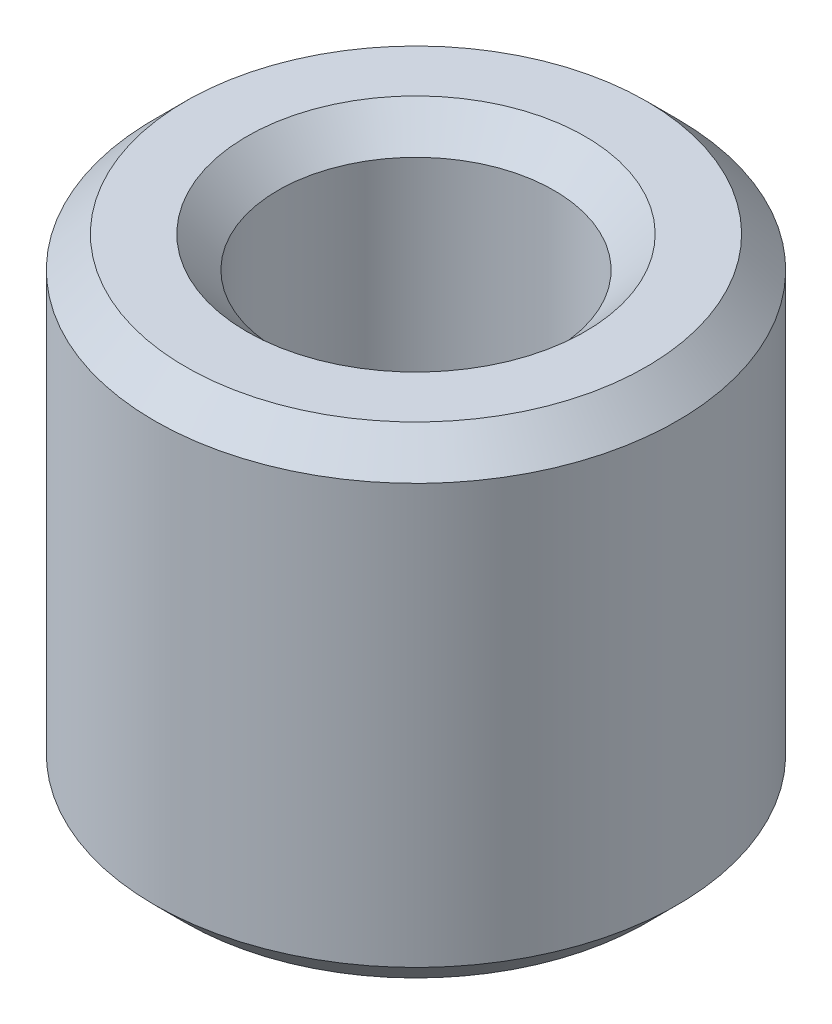
ISO-10303-21;
HEADER;
FILE_DESCRIPTION(('STEP AP214'),'2;1');
FILE_NAME('part.step','',(''),(''),'','','');
FILE_SCHEMA(('AUTOMOTIVE_DESIGN { 1 0 10303 214 1 1 1 1 }'));
ENDSEC;
DATA;
#1=APPLICATION_CONTEXT('core data for automotive mechanical design processes');
#2=APPLICATION_PROTOCOL_DEFINITION('international standard','automotive_design',2000,#1);
#3=PRODUCT_CONTEXT('',#1,'mechanical');
#4=PRODUCT('Part','Part','',(#3));
#5=PRODUCT_RELATED_PRODUCT_CATEGORY('part','',(#4));
#6=PRODUCT_DEFINITION_FORMATION('','',#4);
#7=PRODUCT_DEFINITION_CONTEXT('part definition',#1,'design');
#8=PRODUCT_DEFINITION('design','',#6,#7);
#9=PRODUCT_DEFINITION_SHAPE('','',#8);
#10=(LENGTH_UNIT() NAMED_UNIT(*) SI_UNIT(.MILLI.,.METRE.));
#11=(NAMED_UNIT(*) PLANE_ANGLE_UNIT() SI_UNIT($,.RADIAN.));
#12=(NAMED_UNIT(*) SI_UNIT($,.STERADIAN.) SOLID_ANGLE_UNIT());
#13=UNCERTAINTY_MEASURE_WITH_UNIT(LENGTH_MEASURE(1.E-05),#10,'distance_accuracy_value','');
#14=(GEOMETRIC_REPRESENTATION_CONTEXT(3) GLOBAL_UNCERTAINTY_ASSIGNED_CONTEXT((#13)) GLOBAL_UNIT_ASSIGNED_CONTEXT((#10,
#11,#12)) REPRESENTATION_CONTEXT('',''));
#15=CARTESIAN_POINT('',(0.,0.,0.));
#16=DIRECTION('',(0.,0.,1.));
#17=DIRECTION('',(1.,0.,0.));
#18=AXIS2_PLACEMENT_3D('',#15,#16,#17);
#19=CARTESIAN_POINT('',(0.,13.8149802318083,0.));
#20=DIRECTION('',(0.,-1.,0.));
#21=DIRECTION('',(0.,0.,-1.));
#22=AXIS2_PLACEMENT_3D('',#19,#20,#21);
#23=CYLINDRICAL_SURFACE('',#22,7.5);
#24=CARTESIAN_POINT('',(0.,0.893719676889084,0.));
#25=DIRECTION('',(0.,1.,0.));
#26=DIRECTION('',(0.,0.,1.));
#27=AXIS2_PLACEMENT_3D('',#24,#25,#26);
#28=CIRCLE('',#27,7.5);
#29=CARTESIAN_POINT('',(0.,0.893719676889084,7.5));
#30=VERTEX_POINT('',#29);
#31=EDGE_CURVE('E10',#30,#30,#28,.T.);
#32=ORIENTED_EDGE('',*,*,#31,.T.);
#33=EDGE_LOOP('',(#32));
#34=FACE_BOUND('',#33,.T.);
#35=CARTESIAN_POINT('',(0.,12.9212605549192,0.));
#36=DIRECTION('',(0.,1.,0.));
#37=DIRECTION('',(0.,0.,1.));
#38=AXIS2_PLACEMENT_3D('',#35,#36,#37);
#39=CIRCLE('',#38,7.5);
#40=CARTESIAN_POINT('',(0.,12.9212605549192,-7.5));
#41=VERTEX_POINT('',#40);
#42=EDGE_CURVE('E50',#41,#41,#39,.F.);
#43=ORIENTED_EDGE('',*,*,#42,.T.);
#44=EDGE_LOOP('',(#43));
#45=FACE_BOUND('',#44,.T.);
#46=ADVANCED_FACE('F39',(#34,#45),#23,.T.);
#47=CARTESIAN_POINT('',(0.,13.8149802318083,0.));
#48=DIRECTION('',(0.,1.,0.));
#49=DIRECTION('',(0.,0.,1.));
#50=AXIS2_PLACEMENT_3D('',#47,#48,#49);
#51=PLANE('',#50);
#52=CARTESIAN_POINT('',(0.,13.8149802318083,0.));
#53=DIRECTION('',(0.,1.,0.));
#54=DIRECTION('',(0.,0.,1.));
#55=AXIS2_PLACEMENT_3D('',#52,#53,#54);
#56=CIRCLE('',#55,4.85291160615916);
#57=CARTESIAN_POINT('',(0.,13.8149802318083,4.85291160615915));
#58=VERTEX_POINT('',#57);
#59=EDGE_CURVE('E58',#58,#58,#56,.F.);
#60=ORIENTED_EDGE('',*,*,#59,.T.);
#61=EDGE_LOOP('',(#60));
#62=FACE_BOUND('',#61,.T.);
#63=CARTESIAN_POINT('',(0.,13.8149802318083,0.));
#64=DIRECTION('',(0.,1.,0.));
#65=DIRECTION('',(0.,0.,1.));
#66=AXIS2_PLACEMENT_3D('',#63,#64,#65);
#67=CIRCLE('',#66,6.60628032311091);
#68=CARTESIAN_POINT('',(0.,13.8149802318083,-6.60628032311091));
#69=VERTEX_POINT('',#68);
#70=EDGE_CURVE('E61',#69,#69,#67,.T.);
#71=ORIENTED_EDGE('',*,*,#70,.T.);
#72=EDGE_LOOP('',(#71));
#73=FACE_BOUND('',#72,.T.);
#74=ADVANCED_FACE('F88',(#62,#73),#51,.T.);
#75=CARTESIAN_POINT('',(0.,0.,0.));
#76=DIRECTION('',(0.,1.,0.));
#77=DIRECTION('',(0.,0.,1.));
#78=AXIS2_PLACEMENT_3D('',#75,#76,#77);
#79=PLANE('',#78);
#80=CARTESIAN_POINT('',(0.,0.,0.));
#81=DIRECTION('',(0.,1.,0.));
#82=DIRECTION('',(0.,0.,1.));
#83=AXIS2_PLACEMENT_3D('',#80,#81,#82);
#84=CIRCLE('',#83,4.85291160615914);
#85=CARTESIAN_POINT('',(0.,0.,4.85291160615914));
#86=VERTEX_POINT('',#85);
#87=EDGE_CURVE('E51',#86,#86,#84,.T.);
#88=ORIENTED_EDGE('',*,*,#87,.T.);
#89=EDGE_LOOP('',(#88));
#90=FACE_BOUND('',#89,.T.);
#91=CARTESIAN_POINT('',(0.,0.,0.));
#92=DIRECTION('',(0.,1.,0.));
#93=DIRECTION('',(0.,0.,1.));
#94=AXIS2_PLACEMENT_3D('',#91,#92,#93);
#95=CIRCLE('',#94,6.60628032311091);
#96=CARTESIAN_POINT('',(0.,0.,6.60628032311091));
#97=VERTEX_POINT('',#96);
#98=EDGE_CURVE('E54',#97,#97,#95,.F.);
#99=ORIENTED_EDGE('',*,*,#98,.T.);
#100=EDGE_LOOP('',(#99));
#101=FACE_BOUND('',#100,.T.);
#102=ADVANCED_FACE('F83',(#90,#101),#79,.F.);
#103=CARTESIAN_POINT('',(0.,13.8149802318083,0.));
#104=DIRECTION('',(0.,-1.,0.));
#105=DIRECTION('',(0.,0.,-1.));
#106=AXIS2_PLACEMENT_3D('',#103,#104,#105);
#107=CYLINDRICAL_SURFACE('',#106,3.95919192927005);
#108=CARTESIAN_POINT('',(0.,12.9212605549192,0.));
#109=DIRECTION('',(0.,1.,0.));
#110=DIRECTION('',(0.,0.,1.));
#111=AXIS2_PLACEMENT_3D('',#108,#109,#110);
#112=CIRCLE('',#111,3.95919192927005);
#113=CARTESIAN_POINT('',(0.,12.9212605549192,3.95919192927005));
#114=VERTEX_POINT('',#113);
#115=EDGE_CURVE('E67',#114,#114,#112,.T.);
#116=ORIENTED_EDGE('',*,*,#115,.T.);
#117=EDGE_LOOP('',(#116));
#118=FACE_BOUND('',#117,.T.);
#119=CARTESIAN_POINT('',(0.,0.8937196768891,0.));
#120=DIRECTION('',(0.,1.,0.));
#121=DIRECTION('',(0.,0.,1.));
#122=AXIS2_PLACEMENT_3D('',#119,#120,#121);
#123=CIRCLE('',#122,3.95919192927005);
#124=CARTESIAN_POINT('',(0.,0.8937196768891,3.95919192927005));
#125=VERTEX_POINT('',#124);
#126=EDGE_CURVE('E69',#125,#125,#123,.F.);
#127=ORIENTED_EDGE('',*,*,#126,.T.);
#128=EDGE_LOOP('',(#127));
#129=FACE_BOUND('',#128,.T.);
#130=ADVANCED_FACE('F71',(#118,#129),#107,.F.);
#131=CARTESIAN_POINT('',(0.,12.9212605549192,0.));
#132=DIRECTION('',(0.,1.,0.));
#133=DIRECTION('',(0.,0.,1.));
#134=AXIS2_PLACEMENT_3D('',#131,#132,#133);
#135=CONICAL_SURFACE('',#134,3.95919192927005,0.785398163397452);
#136=CARTESIAN_POINT('',(0.,13.8149802318083,4.85291160615915));
#137=CARTESIAN_POINT('',(0.,13.8056706518407,4.84360202619156));
#138=CARTESIAN_POINT('',(0.,13.7963610718731,4.83429244622396));
#139=CARTESIAN_POINT('',(0.,13.7777419119379,4.81567328628878));
#140=CARTESIAN_POINT('',(0.,13.7684323319703,4.80636370632118));
#141=CARTESIAN_POINT('',(0.,13.7498131720351,4.78774454638599));
#142=CARTESIAN_POINT('',(0.,13.7405035920675,4.7784349664184));
#143=CARTESIAN_POINT('',(0.,13.7218844321324,4.75981580648321));
#144=CARTESIAN_POINT('',(0.,13.7125748521648,4.75050622651561));
#145=CARTESIAN_POINT('',(0.,13.6939556922296,4.73188706658042));
#146=CARTESIAN_POINT('',(0.,13.684646112262,4.72257748661283));
#147=CARTESIAN_POINT('',(0.,13.6660269523268,4.70395832667764));
#148=CARTESIAN_POINT('',(0.,13.6567173723592,4.69464874671004));
#149=CARTESIAN_POINT('',(0.,13.638098212424,4.67602958677485));
#150=CARTESIAN_POINT('',(0.,13.6287886324564,4.66672000680726));
#151=CARTESIAN_POINT('',(0.,13.6101694725212,4.64810084687207));
#152=CARTESIAN_POINT('',(0.,13.6008598925536,4.63879126690447));
#153=CARTESIAN_POINT('',(0.,13.5822407326184,4.62017210696928));
#154=CARTESIAN_POINT('',(0.,13.5729311526508,4.61086252700169));
#155=CARTESIAN_POINT('',(0.,13.5543119927156,4.5922433670665));
#156=CARTESIAN_POINT('',(0.,13.545002412748,4.5829337870989));
#157=CARTESIAN_POINT('',(0.,13.5263832528129,4.56431462716372));
#158=CARTESIAN_POINT('',(0.,13.5170736728453,4.55500504719612));
#159=CARTESIAN_POINT('',(0.,13.4984545129101,4.53638588726093));
#160=CARTESIAN_POINT('',(0.,13.4891449329425,4.52707630729334));
#161=CARTESIAN_POINT('',(0.,13.4705257730073,4.50845714735815));
#162=CARTESIAN_POINT('',(0.,13.4612161930397,4.49914756739055));
#163=CARTESIAN_POINT('',(0.,13.4425970331045,4.48052840745536));
#164=CARTESIAN_POINT('',(0.,13.4332874531369,4.47121882748777));
#165=CARTESIAN_POINT('',(0.,13.4146682932017,4.45259966755258));
#166=CARTESIAN_POINT('',(0.,13.4053587132341,4.44329008758498));
#167=CARTESIAN_POINT('',(0.,13.3867395532989,4.42467092764979));
#168=CARTESIAN_POINT('',(0.,13.3774299733313,4.4153613476822));
#169=CARTESIAN_POINT('',(0.,13.3588108133962,4.39674218774701));
#170=CARTESIAN_POINT('',(0.,13.3495012334286,4.38743260777941));
#171=CARTESIAN_POINT('',(0.,13.3308820734934,4.36881344784422));
#172=CARTESIAN_POINT('',(0.,13.3215724935258,4.35950386787663));
#173=CARTESIAN_POINT('',(0.,13.3029533335906,4.34088470794144));
#174=CARTESIAN_POINT('',(0.,13.293643753623,4.33157512797384));
#175=CARTESIAN_POINT('',(0.,13.2750245936878,4.31295596803865));
#176=CARTESIAN_POINT('',(0.,13.2657150137202,4.30364638807106));
#177=CARTESIAN_POINT('',(0.,13.247095853785,4.28502722813587));
#178=CARTESIAN_POINT('',(0.,13.2377862738174,4.27571764816827));
#179=CARTESIAN_POINT('',(0.,13.2191671138822,4.25709848823309));
#180=CARTESIAN_POINT('',(0.,13.2098575339146,4.24778890826549));
#181=CARTESIAN_POINT('',(0.,13.1912383739794,4.2291697483303));
#182=CARTESIAN_POINT('',(0.,13.1819287940119,4.21986016836271));
#183=CARTESIAN_POINT('',(0.,13.1633096340767,4.20124100842752));
#184=CARTESIAN_POINT('',(0.,13.1540000541091,4.19193142845992));
#185=CARTESIAN_POINT('',(0.,13.1353808941739,4.17331226852473));
#186=CARTESIAN_POINT('',(0.,13.1260713142063,4.16400268855714));
#187=CARTESIAN_POINT('',(0.,13.1074521542711,4.14538352862195));
#188=CARTESIAN_POINT('',(0.,13.0981425743035,4.13607394865435));
#189=CARTESIAN_POINT('',(0.,13.0795234143683,4.11745478871916));
#190=CARTESIAN_POINT('',(0.,13.0702138344007,4.10814520875157));
#191=CARTESIAN_POINT('',(0.,13.0515946744655,4.08952604881638));
#192=CARTESIAN_POINT('',(0.,13.0422850944979,4.08021646884878));
#193=CARTESIAN_POINT('',(0.,13.0236659345627,4.06159730891359));
#194=CARTESIAN_POINT('',(0.,13.0143563545951,4.052287728946));
#195=CARTESIAN_POINT('',(0.,12.99573719466,4.03366856901081));
#196=CARTESIAN_POINT('',(0.,12.9864276146924,4.02435898904321));
#197=CARTESIAN_POINT('',(0.,12.9678084547572,4.00573982910802));
#198=CARTESIAN_POINT('',(0.,12.9584988747896,3.99643024914043));
#199=CARTESIAN_POINT('',(0.,12.9398797148544,3.97781108920524));
#200=CARTESIAN_POINT('',(0.,12.9305701348868,3.96850150923765));
#201=CARTESIAN_POINT('',(0.,12.9212605549192,3.95919192927005));
#202=B_SPLINE_CURVE_WITH_KNOTS('',3,(#136,#137,#138,#139,#140,#141,#142,#143,#144,#145,#146,
#147,#148,#149,#150,#151,#152,#153,#154,#155,#156,#157,#158,#159,#160,#161,#162,#163,#164,#165,
#166,#167,#168,#169,#170,#171,#172,#173,#174,#175,#176,#177,#178,#179,#180,#181,#182,#183,#184,
#185,#186,#187,#188,#189,#190,#191,#192,#193,#194,#195,#196,#197,#198,#199,#200,#201),
.UNSPECIFIED.,.F.,.F.,(4,2,2,2,2,2,2,2,2,2,2,2,2,2,2,2,2,2,2,2,2,2,2,2,2,2,2,2,2,2,2,2,4),(0.,
0.0394972027505078,0.0789944055010161,0.118491608251525,0.157988811002033,0.197486013752541,
0.23698321650305,0.276480419253557,0.315977622004066,0.355474824754575,0.394972027505082,
0.434469230255591,0.4739664330061,0.513463635756608,0.552960838507117,0.592458041257625,
0.631955244008134,0.671452446758642,0.71094964950915,0.750446852259659,0.789944055010167,
0.829441257760675,0.868938460511184,0.908435663261691,0.9479328660122,0.987430068762709,
1.02692727151322,1.06642447426373,1.10592167701423,1.14541887976474,1.18491608251525,
1.22441328526576,1.26391048801627),.UNSPECIFIED.);
#203=EDGE_CURVE('BSEAM77',#58,#114,#202,.T.);
#204=ORIENTED_EDGE('',*,*,#59,.F.);
#205=ORIENTED_EDGE('',*,*,#115,.F.);
#206=ORIENTED_EDGE('',*,*,#203,.T.);
#207=ORIENTED_EDGE('',*,*,#203,.F.);
#208=EDGE_LOOP('',(#204,#206,#205,#207));
#209=FACE_BOUND('',#208,.T.);
#210=ADVANCED_FACE('F77',(#209),#135,.F.);
#211=CARTESIAN_POINT('',(0.,0.,0.));
#212=DIRECTION('',(0.,-1.,0.));
#213=DIRECTION('',(0.,0.,-1.));
#214=AXIS2_PLACEMENT_3D('',#211,#212,#213);
#215=CONICAL_SURFACE('',#214,4.85291160615914,0.785398163397443);
#216=ORIENTED_EDGE('',*,*,#126,.F.);
#217=EDGE_LOOP('',(#216));
#218=FACE_BOUND('',#217,.T.);
#219=ORIENTED_EDGE('',*,*,#87,.F.);
#220=EDGE_LOOP('',(#219));
#221=FACE_BOUND('',#220,.T.);
#222=ADVANCED_FACE('F73',(#218,#221),#215,.F.);
#223=CARTESIAN_POINT('',(0.,0.893719676889084,0.));
#224=DIRECTION('',(0.,1.,0.));
#225=DIRECTION('',(0.,0.,1.));
#226=AXIS2_PLACEMENT_3D('',#223,#224,#225);
#227=CONICAL_SURFACE('',#226,7.5,0.785398163397451);
#228=ORIENTED_EDGE('',*,*,#98,.F.);
#229=EDGE_LOOP('',(#228));
#230=FACE_BOUND('',#229,.T.);
#231=ORIENTED_EDGE('',*,*,#31,.F.);
#232=EDGE_LOOP('',(#231));
#233=FACE_BOUND('',#232,.T.);
#234=ADVANCED_FACE('F76',(#230,#233),#227,.T.);
#235=CARTESIAN_POINT('',(0.,13.8149802318083,0.));
#236=DIRECTION('',(0.,-1.,0.));
#237=DIRECTION('',(0.,0.,-1.));
#238=AXIS2_PLACEMENT_3D('',#235,#236,#237);
#239=CONICAL_SURFACE('',#238,6.60628032311091,0.785398163397445);
#240=CARTESIAN_POINT('',(0.,12.9212605549192,-7.5));
#241=CARTESIAN_POINT('',(0.,12.9305701348868,-7.49069042003241));
#242=CARTESIAN_POINT('',(0.,12.9398797148544,-7.48138084006481));
#243=CARTESIAN_POINT('',(0.,12.9584988747896,-7.46276168012962));
#244=CARTESIAN_POINT('',(0.,12.9678084547572,-7.45345210016203));
#245=CARTESIAN_POINT('',(0.,12.9864276146924,-7.43483294022684));
#246=CARTESIAN_POINT('',(0.,12.99573719466,-7.42552336025924));
#247=CARTESIAN_POINT('',(0.,13.0143563545951,-7.40690420032405));
#248=CARTESIAN_POINT('',(0.,13.0236659345627,-7.39759462035646));
#249=CARTESIAN_POINT('',(0.,13.0422850944979,-7.37897546042127));
#250=CARTESIAN_POINT('',(0.,13.0515946744655,-7.36966588045368));
#251=CARTESIAN_POINT('',(0.,13.0702138344007,-7.35104672051849));
#252=CARTESIAN_POINT('',(0.,13.0795234143683,-7.34173714055089));
#253=CARTESIAN_POINT('',(0.,13.0981425743035,-7.3231179806157));
#254=CARTESIAN_POINT('',(0.,13.1074521542711,-7.31380840064811));
#255=CARTESIAN_POINT('',(0.,13.1260713142063,-7.29518924071292));
#256=CARTESIAN_POINT('',(0.,13.1353808941739,-7.28587966074532));
#257=CARTESIAN_POINT('',(0.,13.1540000541091,-7.26726050081013));
#258=CARTESIAN_POINT('',(0.,13.1633096340767,-7.25795092084254));
#259=CARTESIAN_POINT('',(0.,13.1819287940119,-7.23933176090735));
#260=CARTESIAN_POINT('',(0.,13.1912383739794,-7.23002218093975));
#261=CARTESIAN_POINT('',(0.,13.2098575339146,-7.21140302100456));
#262=CARTESIAN_POINT('',(0.,13.2191671138822,-7.20209344103697));
#263=CARTESIAN_POINT('',(0.,13.2377862738174,-7.18347428110178));
#264=CARTESIAN_POINT('',(0.,13.247095853785,-7.17416470113419));
#265=CARTESIAN_POINT('',(0.,13.2657150137202,-7.155545541199));
#266=CARTESIAN_POINT('',(0.,13.2750245936878,-7.1462359612314));
#267=CARTESIAN_POINT('',(0.,13.293643753623,-7.12761680129621));
#268=CARTESIAN_POINT('',(0.,13.3029533335906,-7.11830722132862));
#269=CARTESIAN_POINT('',(0.,13.3215724935258,-7.09968806139343));
#270=CARTESIAN_POINT('',(0.,13.3308820734934,-7.09037848142583));
#271=CARTESIAN_POINT('',(0.,13.3495012334286,-7.07175932149064));
#272=CARTESIAN_POINT('',(0.,13.3588108133962,-7.06244974152305));
#273=CARTESIAN_POINT('',(0.,13.3774299733313,-7.04383058158786));
#274=CARTESIAN_POINT('',(0.,13.3867395532989,-7.03452100162027));
#275=CARTESIAN_POINT('',(0.,13.4053587132341,-7.01590184168508));
#276=CARTESIAN_POINT('',(0.,13.4146682932017,-7.00659226171748));
#277=CARTESIAN_POINT('',(0.,13.4332874531369,-6.98797310178229));
#278=CARTESIAN_POINT('',(0.,13.4425970331045,-6.9786635218147));
#279=CARTESIAN_POINT('',(0.,13.4612161930397,-6.96004436187951));
#280=CARTESIAN_POINT('',(0.,13.4705257730073,-6.95073478191191));
#281=CARTESIAN_POINT('',(0.,13.4891449329425,-6.93211562197672));
#282=CARTESIAN_POINT('',(0.,13.4984545129101,-6.92280604200913));
#283=CARTESIAN_POINT('',(0.,13.5170736728453,-6.90418688207394));
#284=CARTESIAN_POINT('',(0.,13.5263832528129,-6.89487730210634));
#285=CARTESIAN_POINT('',(0.,13.545002412748,-6.87625814217116));
#286=CARTESIAN_POINT('',(0.,13.5543119927156,-6.86694856220356));
#287=CARTESIAN_POINT('',(0.,13.5729311526508,-6.84832940226837));
#288=CARTESIAN_POINT('',(0.,13.5822407326184,-6.83901982230078));
#289=CARTESIAN_POINT('',(0.,13.6008598925536,-6.82040066236559));
#290=CARTESIAN_POINT('',(0.,13.6101694725212,-6.81109108239799));
#291=CARTESIAN_POINT('',(0.,13.6287886324564,-6.7924719224628));
#292=CARTESIAN_POINT('',(0.,13.638098212424,-6.78316234249521));
#293=CARTESIAN_POINT('',(0.,13.6567173723592,-6.76454318256002));
#294=CARTESIAN_POINT('',(0.,13.6660269523268,-6.75523360259243));
#295=CARTESIAN_POINT('',(0.,13.684646112262,-6.73661444265724));
#296=CARTESIAN_POINT('',(0.,13.6939556922296,-6.72730486268964));
#297=CARTESIAN_POINT('',(0.,13.7125748521648,-6.70868570275445));
#298=CARTESIAN_POINT('',(0.,13.7218844321324,-6.69937612278686));
#299=CARTESIAN_POINT('',(0.,13.7405035920675,-6.68075696285167));
#300=CARTESIAN_POINT('',(0.,13.7498131720351,-6.67144738288407));
#301=CARTESIAN_POINT('',(0.,13.7684323319703,-6.65282822294888));
#302=CARTESIAN_POINT('',(0.,13.7777419119379,-6.64351864298129));
#303=CARTESIAN_POINT('',(0.,13.7963610718731,-6.6248994830461));
#304=CARTESIAN_POINT('',(0.,13.8056706518407,-6.6155899030785));
#305=CARTESIAN_POINT('',(0.,13.8149802318083,-6.60628032311091));
#306=B_SPLINE_CURVE_WITH_KNOTS('',3,(#240,#241,#242,#243,#244,#245,#246,#247,#248,#249,#250,
#251,#252,#253,#254,#255,#256,#257,#258,#259,#260,#261,#262,#263,#264,#265,#266,#267,#268,#269,
#270,#271,#272,#273,#274,#275,#276,#277,#278,#279,#280,#281,#282,#283,#284,#285,#286,#287,#288,
#289,#290,#291,#292,#293,#294,#295,#296,#297,#298,#299,#300,#301,#302,#303,#304,#305),
.UNSPECIFIED.,.F.,.F.,(4,2,2,2,2,2,2,2,2,2,2,2,2,2,2,2,2,2,2,2,2,2,2,2,2,2,2,2,2,2,2,2,4),(0.,
0.0394972027505084,0.0789944055010167,0.118491608251524,0.157988811002032,0.197486013752541,
0.236983216503049,0.276480419253557,0.315977622004065,0.355474824754573,0.394972027505081,
0.434469230255589,0.473966433006097,0.513463635756604,0.552960838507114,0.592458041257622,
0.631955244008129,0.671452446758637,0.710949649509146,0.750446852259654,0.789944055010161,
0.829441257760669,0.868938460511178,0.908435663261685,0.947932866012194,0.987430068762702,
1.02692727151321,1.06642447426372,1.10592167701423,1.14541887976473,1.18491608251524,
1.22441328526575,1.26391048801626),.UNSPECIFIED.);
#307=EDGE_CURVE('BSEAM45',#41,#69,#306,.T.);
#308=ORIENTED_EDGE('',*,*,#42,.F.);
#309=ORIENTED_EDGE('',*,*,#70,.F.);
#310=ORIENTED_EDGE('',*,*,#307,.T.);
#311=ORIENTED_EDGE('',*,*,#307,.F.);
#312=EDGE_LOOP('',(#308,#310,#309,#311));
#313=FACE_BOUND('',#312,.T.);
#314=ADVANCED_FACE('F45',(#313),#239,.T.);
#315=CLOSED_SHELL('',(#46,#74,#102,#130,#210,#222,#234,#314));
#316=MANIFOLD_SOLID_BREP('B2',#315);
#317=ADVANCED_BREP_SHAPE_REPRESENTATION('',(#18,#316),#14);
#318=SHAPE_DEFINITION_REPRESENTATION(#9,#317);
ENDSEC;
END-ISO-10303-21;
